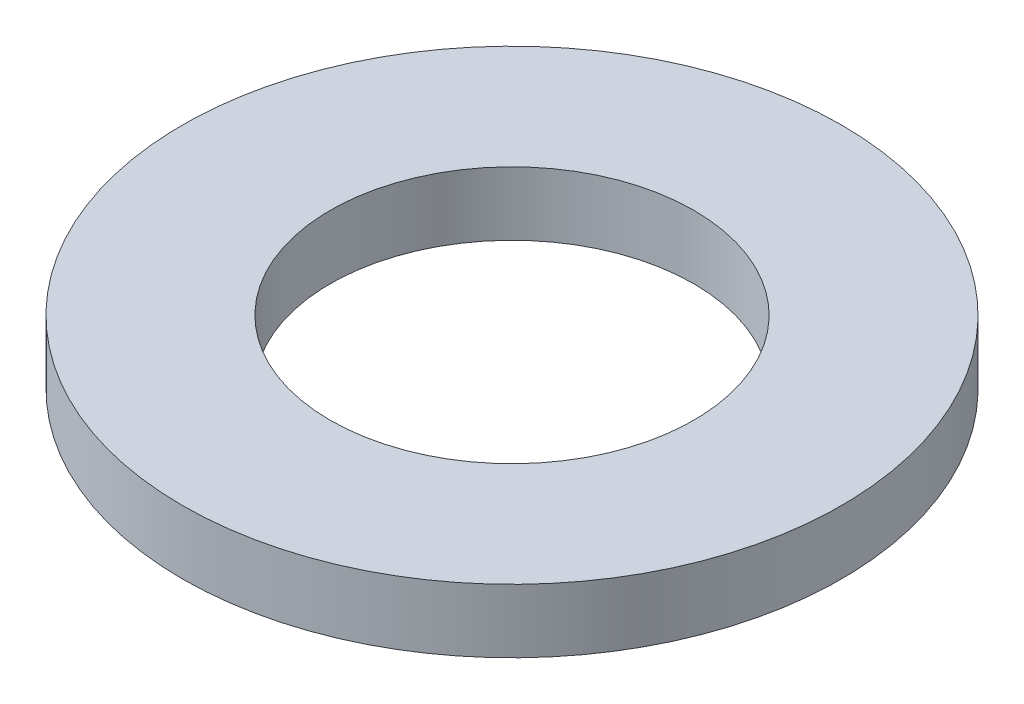
ISO-10303-21;
HEADER;
FILE_DESCRIPTION(('STEP AP214'),'2;1');
FILE_NAME('part.step','',(''),(''),'','','');
FILE_SCHEMA(('AUTOMOTIVE_DESIGN { 1 0 10303 214 1 1 1 1 }'));
ENDSEC;
DATA;
#1=APPLICATION_CONTEXT('core data for automotive mechanical design processes');
#2=APPLICATION_PROTOCOL_DEFINITION('international standard','automotive_design',2000,#1);
#3=PRODUCT_CONTEXT('',#1,'mechanical');
#4=PRODUCT('Part','Part','',(#3));
#5=PRODUCT_RELATED_PRODUCT_CATEGORY('part','',(#4));
#6=PRODUCT_DEFINITION_FORMATION('','',#4);
#7=PRODUCT_DEFINITION_CONTEXT('part definition',#1,'design');
#8=PRODUCT_DEFINITION('design','',#6,#7);
#9=PRODUCT_DEFINITION_SHAPE('','',#8);
#10=(LENGTH_UNIT() NAMED_UNIT(*) SI_UNIT(.MILLI.,.METRE.));
#11=(NAMED_UNIT(*) PLANE_ANGLE_UNIT() SI_UNIT($,.RADIAN.));
#12=(NAMED_UNIT(*) SI_UNIT($,.STERADIAN.) SOLID_ANGLE_UNIT());
#13=UNCERTAINTY_MEASURE_WITH_UNIT(LENGTH_MEASURE(1.E-05),#10,'distance_accuracy_value','');
#14=(GEOMETRIC_REPRESENTATION_CONTEXT(3) GLOBAL_UNCERTAINTY_ASSIGNED_CONTEXT((#13)) GLOBAL_UNIT_ASSIGNED_CONTEXT((#10,
#11,#12)) REPRESENTATION_CONTEXT('',''));
#15=CARTESIAN_POINT('',(0.,0.,0.));
#16=DIRECTION('',(0.,0.,1.));
#17=DIRECTION('',(1.,0.,0.));
#18=AXIS2_PLACEMENT_3D('',#15,#16,#17);
#19=CARTESIAN_POINT('',(0.,14.,0.));
#20=DIRECTION('',(0.,-1.,0.));
#21=DIRECTION('',(0.,0.,-1.));
#22=AXIS2_PLACEMENT_3D('',#19,#20,#21);
#23=CYLINDRICAL_SURFACE('',#22,72.5);
#24=CARTESIAN_POINT('',(0.,14.,0.));
#25=DIRECTION('',(0.,1.,0.));
#26=DIRECTION('',(0.,0.,1.));
#27=AXIS2_PLACEMENT_3D('',#24,#25,#26);
#28=CIRCLE('',#27,72.5);
#29=CARTESIAN_POINT('',(0.,14.,72.5));
#30=VERTEX_POINT('',#29);
#31=EDGE_CURVE('E10',#30,#30,#28,.T.);
#32=ORIENTED_EDGE('',*,*,#31,.F.);
#33=EDGE_LOOP('',(#32));
#34=FACE_BOUND('',#33,.T.);
#35=CARTESIAN_POINT('',(0.,0.,0.));
#36=DIRECTION('',(0.,1.,0.));
#37=DIRECTION('',(0.,0.,1.));
#38=AXIS2_PLACEMENT_3D('',#35,#36,#37);
#39=CIRCLE('',#38,72.5);
#40=CARTESIAN_POINT('',(0.,0.,72.5));
#41=VERTEX_POINT('',#40);
#42=EDGE_CURVE('E37',#41,#41,#39,.T.);
#43=ORIENTED_EDGE('',*,*,#42,.T.);
#44=EDGE_LOOP('',(#43));
#45=FACE_BOUND('',#44,.T.);
#46=ADVANCED_FACE('F40',(#34,#45),#23,.T.);
#47=CARTESIAN_POINT('',(0.,14.,0.));
#48=DIRECTION('',(0.,1.,0.));
#49=DIRECTION('',(0.,0.,1.));
#50=AXIS2_PLACEMENT_3D('',#47,#48,#49);
#51=PLANE('',#50);
#52=CARTESIAN_POINT('',(0.,14.,0.));
#53=DIRECTION('',(0.,1.,0.));
#54=DIRECTION('',(0.,0.,1.));
#55=AXIS2_PLACEMENT_3D('',#52,#53,#54);
#56=CIRCLE('',#55,40.);
#57=CARTESIAN_POINT('',(0.,14.,40.));
#58=VERTEX_POINT('',#57);
#59=EDGE_CURVE('E50',#58,#58,#56,.T.);
#60=ORIENTED_EDGE('',*,*,#59,.F.);
#61=EDGE_LOOP('',(#60));
#62=FACE_BOUND('',#61,.T.);
#63=ORIENTED_EDGE('',*,*,#31,.T.);
#64=EDGE_LOOP('',(#63));
#65=FACE_BOUND('',#64,.T.);
#66=ADVANCED_FACE('F59',(#62,#65),#51,.T.);
#67=CARTESIAN_POINT('',(0.,0.,0.));
#68=DIRECTION('',(0.,1.,0.));
#69=DIRECTION('',(0.,0.,1.));
#70=AXIS2_PLACEMENT_3D('',#67,#68,#69);
#71=PLANE('',#70);
#72=CARTESIAN_POINT('',(0.,0.,0.));
#73=DIRECTION('',(0.,1.,0.));
#74=DIRECTION('',(0.,0.,1.));
#75=AXIS2_PLACEMENT_3D('',#72,#73,#74);
#76=CIRCLE('',#75,40.);
#77=CARTESIAN_POINT('',(0.,0.,40.));
#78=VERTEX_POINT('',#77);
#79=EDGE_CURVE('E47',#78,#78,#76,.T.);
#80=ORIENTED_EDGE('',*,*,#79,.T.);
#81=EDGE_LOOP('',(#80));
#82=FACE_BOUND('',#81,.T.);
#83=ORIENTED_EDGE('',*,*,#42,.F.);
#84=EDGE_LOOP('',(#83));
#85=FACE_BOUND('',#84,.T.);
#86=ADVANCED_FACE('F58',(#82,#85),#71,.F.);
#87=CARTESIAN_POINT('',(0.,14.,0.));
#88=DIRECTION('',(0.,-1.,0.));
#89=DIRECTION('',(0.,0.,-1.));
#90=AXIS2_PLACEMENT_3D('',#87,#88,#89);
#91=CYLINDRICAL_SURFACE('',#90,40.);
#92=ORIENTED_EDGE('',*,*,#59,.T.);
#93=EDGE_LOOP('',(#92));
#94=FACE_BOUND('',#93,.T.);
#95=ORIENTED_EDGE('',*,*,#79,.F.);
#96=EDGE_LOOP('',(#95));
#97=FACE_BOUND('',#96,.T.);
#98=ADVANCED_FACE('F54',(#94,#97),#91,.F.);
#99=CLOSED_SHELL('',(#46,#66,#86,#98));
#100=MANIFOLD_SOLID_BREP('B2',#99);
#101=ADVANCED_BREP_SHAPE_REPRESENTATION('',(#18,#100),#14);
#102=SHAPE_DEFINITION_REPRESENTATION(#9,#101);
ENDSEC;
END-ISO-10303-21;
